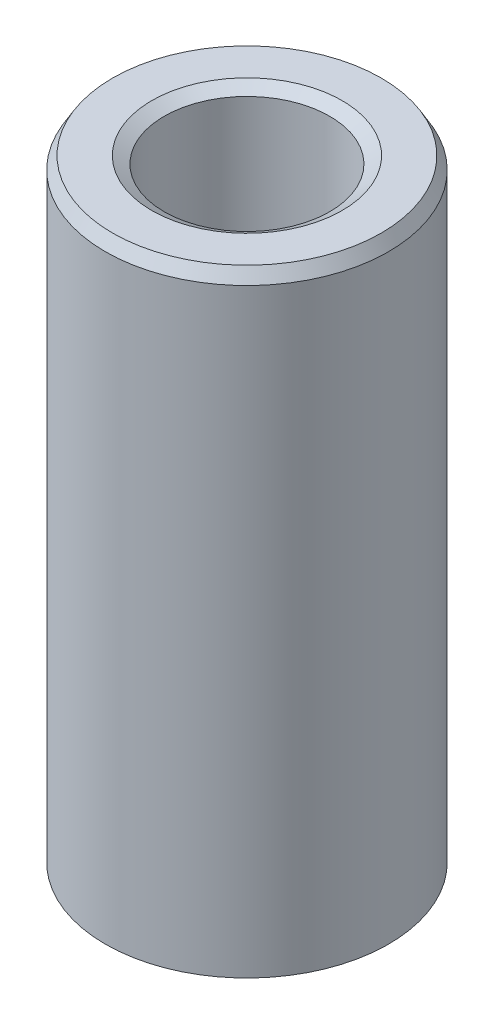
ISO-10303-21;
HEADER;
FILE_DESCRIPTION(('STEP AP214'),'2;1');
FILE_NAME('part.step','',(''),(''),'','','');
FILE_SCHEMA(('AUTOMOTIVE_DESIGN { 1 0 10303 214 1 1 1 1 }'));
ENDSEC;
DATA;
#1=APPLICATION_CONTEXT('core data for automotive mechanical design processes');
#2=APPLICATION_PROTOCOL_DEFINITION('international standard','automotive_design',2000,#1);
#3=PRODUCT_CONTEXT('',#1,'mechanical');
#4=PRODUCT('Part','Part','',(#3));
#5=PRODUCT_RELATED_PRODUCT_CATEGORY('part','',(#4));
#6=PRODUCT_DEFINITION_FORMATION('','',#4);
#7=PRODUCT_DEFINITION_CONTEXT('part definition',#1,'design');
#8=PRODUCT_DEFINITION('design','',#6,#7);
#9=PRODUCT_DEFINITION_SHAPE('','',#8);
#10=(LENGTH_UNIT() NAMED_UNIT(*) SI_UNIT(.MILLI.,.METRE.));
#11=(NAMED_UNIT(*) PLANE_ANGLE_UNIT() SI_UNIT($,.RADIAN.));
#12=(NAMED_UNIT(*) SI_UNIT($,.STERADIAN.) SOLID_ANGLE_UNIT());
#13=UNCERTAINTY_MEASURE_WITH_UNIT(LENGTH_MEASURE(1.E-05),#10,'distance_accuracy_value','');
#14=(GEOMETRIC_REPRESENTATION_CONTEXT(3) GLOBAL_UNCERTAINTY_ASSIGNED_CONTEXT((#13)) GLOBAL_UNIT_ASSIGNED_CONTEXT((#10,
#11,#12)) REPRESENTATION_CONTEXT('',''));
#15=CARTESIAN_POINT('',(0.,0.,0.));
#16=DIRECTION('',(0.,0.,1.));
#17=DIRECTION('',(1.,0.,0.));
#18=AXIS2_PLACEMENT_3D('',#15,#16,#17);
#19=CARTESIAN_POINT('',(0.,43.7421576596576,0.));
#20=DIRECTION('',(0.,-1.,0.));
#21=DIRECTION('',(0.,0.,-1.));
#22=AXIS2_PLACEMENT_3D('',#19,#20,#21);
#23=CYLINDRICAL_SURFACE('',#22,10.);
#24=CARTESIAN_POINT('',(0.,0.515276524663995,0.));
#25=DIRECTION('',(0.,1.,0.));
#26=DIRECTION('',(0.,0.,1.));
#27=AXIS2_PLACEMENT_3D('',#24,#25,#26);
#28=CIRCLE('',#27,10.);
#29=CARTESIAN_POINT('',(0.,0.515276524663995,10.));
#30=VERTEX_POINT('',#29);
#31=EDGE_CURVE('E10',#30,#30,#28,.T.);
#32=ORIENTED_EDGE('',*,*,#31,.T.);
#33=EDGE_LOOP('',(#32));
#34=FACE_BOUND('',#33,.T.);
#35=CARTESIAN_POINT('',(0.,42.8623619749691,0.));
#36=DIRECTION('',(0.,1.,0.));
#37=DIRECTION('',(0.,0.,1.));
#38=AXIS2_PLACEMENT_3D('',#35,#36,#37);
#39=CIRCLE('',#38,10.);
#40=CARTESIAN_POINT('',(0.,42.8623619749691,10.));
#41=VERTEX_POINT('',#40);
#42=EDGE_CURVE('E50',#41,#41,#39,.F.);
#43=ORIENTED_EDGE('',*,*,#42,.T.);
#44=EDGE_LOOP('',(#43));
#45=FACE_BOUND('',#44,.T.);
#46=ADVANCED_FACE('F39',(#34,#45),#23,.T.);
#47=CARTESIAN_POINT('',(0.,43.7421576596576,0.));
#48=DIRECTION('',(0.,1.,0.));
#49=DIRECTION('',(0.,0.,1.));
#50=AXIS2_PLACEMENT_3D('',#47,#48,#49);
#51=PLANE('',#50);
#52=CARTESIAN_POINT('',(0.,43.7421576596576,0.));
#53=DIRECTION('',(0.,1.,0.));
#54=DIRECTION('',(0.,0.,1.));
#55=AXIS2_PLACEMENT_3D('',#52,#53,#54);
#56=CIRCLE('',#55,6.72399129558816);
#57=CARTESIAN_POINT('',(0.,43.7421576596576,6.72399129558816));
#58=VERTEX_POINT('',#57);
#59=EDGE_CURVE('E58',#58,#58,#56,.F.);
#60=ORIENTED_EDGE('',*,*,#59,.T.);
#61=EDGE_LOOP('',(#60));
#62=FACE_BOUND('',#61,.T.);
#63=CARTESIAN_POINT('',(0.,43.7421576596576,0.));
#64=DIRECTION('',(0.,1.,0.));
#65=DIRECTION('',(0.,0.,1.));
#66=AXIS2_PLACEMENT_3D('',#63,#64,#65);
#67=CIRCLE('',#66,9.484723475336);
#68=CARTESIAN_POINT('',(0.,43.7421576596576,9.484723475336));
#69=VERTEX_POINT('',#68);
#70=EDGE_CURVE('E61',#69,#69,#67,.T.);
#71=ORIENTED_EDGE('',*,*,#70,.T.);
#72=EDGE_LOOP('',(#71));
#73=FACE_BOUND('',#72,.T.);
#74=ADVANCED_FACE('F88',(#62,#73),#51,.T.);
#75=CARTESIAN_POINT('',(0.,0.,0.));
#76=DIRECTION('',(0.,1.,0.));
#77=DIRECTION('',(0.,0.,1.));
#78=AXIS2_PLACEMENT_3D('',#75,#76,#77);
#79=PLANE('',#78);
#80=CARTESIAN_POINT('',(0.,0.,0.));
#81=DIRECTION('',(0.,1.,0.));
#82=DIRECTION('',(0.,0.,1.));
#83=AXIS2_PLACEMENT_3D('',#80,#81,#82);
#84=CIRCLE('',#83,6.35947213556373);
#85=CARTESIAN_POINT('',(0.,0.,6.35947213556373));
#86=VERTEX_POINT('',#85);
#87=EDGE_CURVE('E51',#86,#86,#84,.T.);
#88=ORIENTED_EDGE('',*,*,#87,.T.);
#89=EDGE_LOOP('',(#88));
#90=FACE_BOUND('',#89,.T.);
#91=CARTESIAN_POINT('',(0.,0.,0.));
#92=DIRECTION('',(0.,1.,0.));
#93=DIRECTION('',(0.,0.,1.));
#94=AXIS2_PLACEMENT_3D('',#91,#92,#93);
#95=CIRCLE('',#94,9.12020431531157);
#96=CARTESIAN_POINT('',(0.,0.,9.12020431531157));
#97=VERTEX_POINT('',#96);
#98=EDGE_CURVE('E54',#97,#97,#95,.F.);
#99=ORIENTED_EDGE('',*,*,#98,.T.);
#100=EDGE_LOOP('',(#99));
#101=FACE_BOUND('',#100,.T.);
#102=ADVANCED_FACE('F83',(#90,#101),#79,.F.);
#103=CARTESIAN_POINT('',(0.,43.7421576596576,0.));
#104=DIRECTION('',(0.,-1.,0.));
#105=DIRECTION('',(0.,0.,-1.));
#106=AXIS2_PLACEMENT_3D('',#103,#104,#105);
#107=CYLINDRICAL_SURFACE('',#106,5.84419561089974);
#108=CARTESIAN_POINT('',(0.,43.2268811349936,0.));
#109=DIRECTION('',(0.,1.,0.));
#110=DIRECTION('',(0.,0.,1.));
#111=AXIS2_PLACEMENT_3D('',#108,#109,#110);
#112=CIRCLE('',#111,5.84419561089974);
#113=CARTESIAN_POINT('',(0.,43.2268811349936,5.84419561089974));
#114=VERTEX_POINT('',#113);
#115=EDGE_CURVE('E67',#114,#114,#112,.T.);
#116=ORIENTED_EDGE('',*,*,#115,.T.);
#117=EDGE_LOOP('',(#116));
#118=FACE_BOUND('',#117,.T.);
#119=CARTESIAN_POINT('',(0.,0.87979568468844,0.));
#120=DIRECTION('',(0.,1.,0.));
#121=DIRECTION('',(0.,0.,1.));
#122=AXIS2_PLACEMENT_3D('',#119,#120,#121);
#123=CIRCLE('',#122,5.84419561089974);
#124=CARTESIAN_POINT('',(0.,0.87979568468844,5.84419561089974));
#125=VERTEX_POINT('',#124);
#126=EDGE_CURVE('E69',#125,#125,#123,.F.);
#127=ORIENTED_EDGE('',*,*,#126,.T.);
#128=EDGE_LOOP('',(#127));
#129=FACE_BOUND('',#128,.T.);
#130=ADVANCED_FACE('F71',(#118,#129),#107,.F.);
#131=CARTESIAN_POINT('',(0.,43.2268811349936,0.));
#132=DIRECTION('',(0.,1.,0.));
#133=DIRECTION('',(0.,0.,1.));
#134=AXIS2_PLACEMENT_3D('',#131,#132,#133);
#135=CONICAL_SURFACE('',#134,5.84419561089974,1.04097465777376);
#136=ORIENTED_EDGE('',*,*,#59,.F.);
#137=EDGE_LOOP('',(#136));
#138=FACE_BOUND('',#137,.T.);
#139=ORIENTED_EDGE('',*,*,#115,.F.);
#140=EDGE_LOOP('',(#139));
#141=FACE_BOUND('',#140,.T.);
#142=ADVANCED_FACE('F77',(#138,#141),#135,.F.);
#143=CARTESIAN_POINT('',(0.,0.,0.));
#144=DIRECTION('',(0.,-1.,0.));
#145=DIRECTION('',(0.,0.,-1.));
#146=AXIS2_PLACEMENT_3D('',#143,#144,#145);
#147=CONICAL_SURFACE('',#146,6.35947213556373,0.529821669021123);
#148=ORIENTED_EDGE('',*,*,#126,.F.);
#149=EDGE_LOOP('',(#148));
#150=FACE_BOUND('',#149,.T.);
#151=ORIENTED_EDGE('',*,*,#87,.F.);
#152=EDGE_LOOP('',(#151));
#153=FACE_BOUND('',#152,.T.);
#154=ADVANCED_FACE('F73',(#150,#153),#147,.F.);
#155=CARTESIAN_POINT('',(0.,0.515276524663995,0.));
#156=DIRECTION('',(0.,1.,0.));
#157=DIRECTION('',(0.,0.,1.));
#158=AXIS2_PLACEMENT_3D('',#155,#156,#157);
#159=CONICAL_SURFACE('',#158,10.,1.04097465777377);
#160=ORIENTED_EDGE('',*,*,#98,.F.);
#161=EDGE_LOOP('',(#160));
#162=FACE_BOUND('',#161,.T.);
#163=ORIENTED_EDGE('',*,*,#31,.F.);
#164=EDGE_LOOP('',(#163));
#165=FACE_BOUND('',#164,.T.);
#166=ADVANCED_FACE('F76',(#162,#165),#159,.T.);
#167=CARTESIAN_POINT('',(0.,43.7421576596576,0.));
#168=DIRECTION('',(0.,-1.,0.));
#169=DIRECTION('',(0.,0.,-1.));
#170=AXIS2_PLACEMENT_3D('',#167,#168,#169);
#171=CONICAL_SURFACE('',#170,9.484723475336,0.529821669021125);
#172=ORIENTED_EDGE('',*,*,#42,.F.);
#173=EDGE_LOOP('',(#172));
#174=FACE_BOUND('',#173,.T.);
#175=ORIENTED_EDGE('',*,*,#70,.F.);
#176=EDGE_LOOP('',(#175));
#177=FACE_BOUND('',#176,.T.);
#178=ADVANCED_FACE('F45',(#174,#177),#171,.T.);
#179=CLOSED_SHELL('',(#46,#74,#102,#130,#142,#154,#166,#178));
#180=MANIFOLD_SOLID_BREP('B2',#179);
#181=ADVANCED_BREP_SHAPE_REPRESENTATION('',(#18,#180),#14);
#182=SHAPE_DEFINITION_REPRESENTATION(#9,#181);
ENDSEC;
END-ISO-10303-21;
